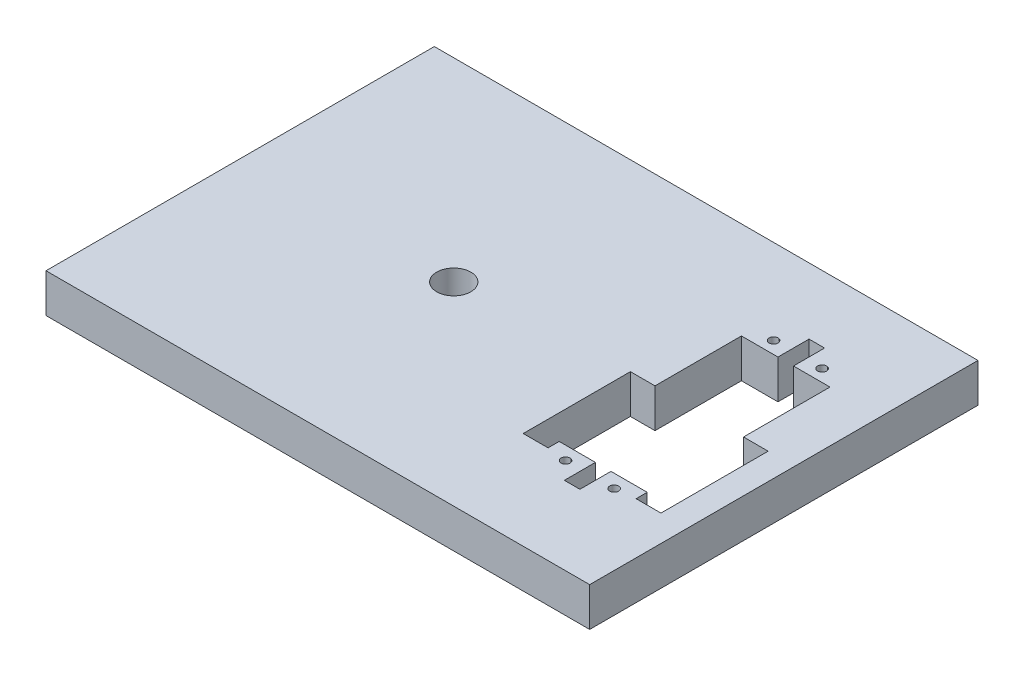
ISO-10303-21;
HEADER;
FILE_DESCRIPTION(('STEP AP214'),'2;1');
FILE_NAME('part.step','',(''),(''),'','','');
FILE_SCHEMA(('AUTOMOTIVE_DESIGN { 1 0 10303 214 1 1 1 1 }'));
ENDSEC;
DATA;
#1=APPLICATION_CONTEXT('core data for automotive mechanical design processes');
#2=APPLICATION_PROTOCOL_DEFINITION('international standard','automotive_design',2000,#1);
#3=PRODUCT_CONTEXT('',#1,'mechanical');
#4=PRODUCT('Part','Part','',(#3));
#5=PRODUCT_RELATED_PRODUCT_CATEGORY('part','',(#4));
#6=PRODUCT_DEFINITION_FORMATION('','',#4);
#7=PRODUCT_DEFINITION_CONTEXT('part definition',#1,'design');
#8=PRODUCT_DEFINITION('design','',#6,#7);
#9=PRODUCT_DEFINITION_SHAPE('','',#8);
#10=(LENGTH_UNIT() NAMED_UNIT(*) SI_UNIT(.MILLI.,.METRE.));
#11=(NAMED_UNIT(*) PLANE_ANGLE_UNIT() SI_UNIT($,.RADIAN.));
#12=(NAMED_UNIT(*) SI_UNIT($,.STERADIAN.) SOLID_ANGLE_UNIT());
#13=UNCERTAINTY_MEASURE_WITH_UNIT(LENGTH_MEASURE(1.E-05),#10,'distance_accuracy_value','');
#14=(GEOMETRIC_REPRESENTATION_CONTEXT(3) GLOBAL_UNCERTAINTY_ASSIGNED_CONTEXT((#13)) GLOBAL_UNIT_ASSIGNED_CONTEXT((#10,
#11,#12)) REPRESENTATION_CONTEXT('',''));
#15=CARTESIAN_POINT('',(0.,0.,0.));
#16=DIRECTION('',(0.,0.,1.));
#17=DIRECTION('',(1.,0.,0.));
#18=AXIS2_PLACEMENT_3D('',#15,#16,#17);
#19=CARTESIAN_POINT('',(0.,12.7,0.));
#20=DIRECTION('',(0.,1.,0.));
#21=DIRECTION('',(0.,0.,1.));
#22=AXIS2_PLACEMENT_3D('',#19,#20,#21);
#23=PLANE('',#22);
#24=CARTESIAN_POINT('',(49.8255656952032,12.7,-35.7195444521175));
#25=DIRECTION('',(0.,1.,0.));
#26=DIRECTION('',(0.,0.,1.));
#27=AXIS2_PLACEMENT_3D('',#24,#25,#26);
#28=CIRCLE('',#27,1.4605);
#29=CARTESIAN_POINT('',(49.8255656952032,12.7,-34.2590444521175));
#30=VERTEX_POINT('',#29);
#31=EDGE_CURVE('E395',#30,#30,#28,.T.);
#32=ORIENTED_EDGE('',*,*,#31,.F.);
#33=EDGE_LOOP('',(#32));
#34=FACE_BOUND('',#33,.T.);
#35=CARTESIAN_POINT('',(49.8255656952034,12.7,32.3016555478825));
#36=DIRECTION('',(0.,1.,0.));
#37=DIRECTION('',(0.,0.,1.));
#38=AXIS2_PLACEMENT_3D('',#35,#36,#37);
#39=CIRCLE('',#38,1.4605);
#40=CARTESIAN_POINT('',(49.8255656952034,12.7,33.7621555478825));
#41=VERTEX_POINT('',#40);
#42=EDGE_CURVE('E237',#41,#41,#39,.T.);
#43=ORIENTED_EDGE('',*,*,#42,.F.);
#44=EDGE_LOOP('',(#43));
#45=FACE_BOUND('',#44,.T.);
#46=DIRECTION('',(0.,0.,-1.));
#47=VECTOR('',#46,1.);
#48=CARTESIAN_POINT('',(88.9,12.7,-63.5));
#49=LINE('',#48,#47);
#50=CARTESIAN_POINT('',(88.9,12.7,63.5));
#51=VERTEX_POINT('',#50);
#52=CARTESIAN_POINT('',(88.9,12.7,-63.5));
#53=VERTEX_POINT('',#52);
#54=EDGE_CURVE('E257',#51,#53,#49,.T.);
#55=ORIENTED_EDGE('',*,*,#54,.T.);
#56=DIRECTION('',(-1.,0.,0.));
#57=VECTOR('',#56,1.);
#58=CARTESIAN_POINT('',(-88.9,12.7,-63.5));
#59=LINE('',#58,#57);
#60=CARTESIAN_POINT('',(-88.9,12.7,-63.5));
#61=VERTEX_POINT('',#60);
#62=EDGE_CURVE('E260',#53,#61,#59,.T.);
#63=ORIENTED_EDGE('',*,*,#62,.T.);
#64=DIRECTION('',(0.,0.,1.));
#65=VECTOR('',#64,1.);
#66=CARTESIAN_POINT('',(-88.9,12.7,-63.5));
#67=LINE('',#66,#65);
#68=CARTESIAN_POINT('',(-88.9,12.7,63.5));
#69=VERTEX_POINT('',#68);
#70=EDGE_CURVE('E263',#61,#69,#67,.T.);
#71=ORIENTED_EDGE('',*,*,#70,.T.);
#72=DIRECTION('',(1.,0.,0.));
#73=VECTOR('',#72,1.);
#74=CARTESIAN_POINT('',(-88.9,12.7,63.5));
#75=LINE('',#74,#73);
#76=EDGE_CURVE('E265',#69,#51,#75,.T.);
#77=ORIENTED_EDGE('',*,*,#76,.T.);
#78=EDGE_LOOP('',(#55,#63,#71,#77));
#79=FACE_BOUND('',#78,.T.);
#80=CARTESIAN_POINT('',(-19.05,12.7,0.));
#81=DIRECTION('',(0.,1.,0.));
#82=DIRECTION('',(0.,0.,1.));
#83=AXIS2_PLACEMENT_3D('',#80,#81,#82);
#84=CIRCLE('',#83,5.58799999999999);
#85=CARTESIAN_POINT('',(-19.05,12.7,5.58799999999998));
#86=VERTEX_POINT('',#85);
#87=EDGE_CURVE('E251',#86,#86,#84,.T.);
#88=ORIENTED_EDGE('',*,*,#87,.F.);
#89=EDGE_LOOP('',(#88));
#90=FACE_BOUND('',#89,.T.);
#91=CARTESIAN_POINT('',(65.7005656952038,12.7,32.3016555478825));
#92=DIRECTION('',(0.,1.,0.));
#93=DIRECTION('',(0.,0.,1.));
#94=AXIS2_PLACEMENT_3D('',#91,#92,#93);
#95=CIRCLE('',#94,1.46049999999967);
#96=CARTESIAN_POINT('',(65.7005656952038,12.7,33.7621555478822));
#97=VERTEX_POINT('',#96);
#98=EDGE_CURVE('E401',#97,#97,#95,.T.);
#99=ORIENTED_EDGE('',*,*,#98,.F.);
#100=EDGE_LOOP('',(#99));
#101=FACE_BOUND('',#100,.T.);
#102=CARTESIAN_POINT('',(65.7005656952032,12.7,-35.7195444521175));
#103=DIRECTION('',(0.,1.,0.));
#104=DIRECTION('',(0.,0.,1.));
#105=AXIS2_PLACEMENT_3D('',#102,#103,#104);
#106=CIRCLE('',#105,1.4605);
#107=CARTESIAN_POINT('',(65.7005656952032,12.7,-34.2590444521175));
#108=VERTEX_POINT('',#107);
#109=EDGE_CURVE('E389',#108,#108,#106,.T.);
#110=ORIENTED_EDGE('',*,*,#109,.F.);
#111=EDGE_LOOP('',(#110));
#112=FACE_BOUND('',#111,.T.);
#113=DIRECTION('',(-1.,0.,0.));
#114=VECTOR('',#113,1.);
#115=CARTESIAN_POINT('',(43.2850656952034,12.7,-31.7539694521175));
#116=LINE('',#115,#114);
#117=CARTESIAN_POINT('',(55.2230656952043,12.7,-31.7539694521175));
#118=VERTEX_POINT('',#117);
#119=CARTESIAN_POINT('',(43.2850656952034,12.7,-31.7539694521175));
#120=VERTEX_POINT('',#119);
#121=EDGE_CURVE('E214',#118,#120,#116,.T.);
#122=ORIENTED_EDGE('',*,*,#121,.F.);
#123=DIRECTION('',(0.,0.,1.));
#124=VECTOR('',#123,1.);
#125=CARTESIAN_POINT('',(55.2230656952043,12.7,-41.9139694521175));
#126=LINE('',#125,#124);
#127=CARTESIAN_POINT('',(55.2230656952043,12.7,-41.9139694521175));
#128=VERTEX_POINT('',#127);
#129=EDGE_CURVE('E197',#128,#118,#126,.T.);
#130=ORIENTED_EDGE('',*,*,#129,.F.);
#131=DIRECTION('',(-1.,0.,0.));
#132=VECTOR('',#131,1.);
#133=CARTESIAN_POINT('',(55.2230656952043,12.7,-41.9139694521175));
#134=LINE('',#133,#132);
#135=CARTESIAN_POINT('',(60.303065695204,12.7,-41.9139694521175));
#136=VERTEX_POINT('',#135);
#137=EDGE_CURVE('E307',#136,#128,#134,.T.);
#138=ORIENTED_EDGE('',*,*,#137,.F.);
#139=DIRECTION('',(0.,0.,-1.));
#140=VECTOR('',#139,1.);
#141=CARTESIAN_POINT('',(60.303065695204,12.7,-41.9139694521175));
#142=LINE('',#141,#140);
#143=CARTESIAN_POINT('',(60.303065695204,12.7,-31.7539694521175));
#144=VERTEX_POINT('',#143);
#145=EDGE_CURVE('E207',#144,#136,#142,.T.);
#146=ORIENTED_EDGE('',*,*,#145,.F.);
#147=CARTESIAN_POINT('',(72.2410656952034,12.7,-31.7539694521175));
#148=VERTEX_POINT('',#147);
#149=EDGE_CURVE('E224',#148,#144,#116,.T.);
#150=ORIENTED_EDGE('',*,*,#149,.F.);
#151=DIRECTION('',(0.,0.,-1.));
#152=VECTOR('',#151,1.);
#153=CARTESIAN_POINT('',(72.2410656952034,12.7,27.9360305478825));
#154=LINE('',#153,#152);
#155=CARTESIAN_POINT('',(72.2410656952034,12.7,-3.48059445211715));
#156=VERTEX_POINT('',#155);
#157=EDGE_CURVE('E225',#156,#148,#154,.T.);
#158=ORIENTED_EDGE('',*,*,#157,.F.);
#159=DIRECTION('',(-1.,0.,0.));
#160=VECTOR('',#159,1.);
#161=CARTESIAN_POINT('',(72.1601426080094,12.7,-3.48059445211715));
#162=LINE('',#161,#160);
#163=CARTESIAN_POINT('',(80.2881426080094,12.7,-3.48059445211715));
#164=VERTEX_POINT('',#163);
#165=EDGE_CURVE('E364',#164,#156,#162,.T.);
#166=ORIENTED_EDGE('',*,*,#165,.F.);
#167=DIRECTION('',(0.,0.,-1.));
#168=VECTOR('',#167,1.);
#169=CARTESIAN_POINT('',(80.2881426080094,12.7,-3.48059445211715));
#170=LINE('',#169,#168);
#171=CARTESIAN_POINT('',(80.2881426080094,12.7,31.5714055478828));
#172=VERTEX_POINT('',#171);
#173=EDGE_CURVE('E362',#172,#164,#170,.T.);
#174=ORIENTED_EDGE('',*,*,#173,.F.);
#175=DIRECTION('',(1.,0.,0.));
#176=VECTOR('',#175,1.);
#177=CARTESIAN_POINT('',(72.1601426080094,12.7,31.5714055478828));
#178=LINE('',#177,#176);
#179=CARTESIAN_POINT('',(72.1601426080094,12.7,31.5714055478828));
#180=VERTEX_POINT('',#179);
#181=EDGE_CURVE('E369',#180,#172,#178,.T.);
#182=ORIENTED_EDGE('',*,*,#181,.F.);
#183=DIRECTION('',(0.,0.,1.));
#184=VECTOR('',#183,1.);
#185=CARTESIAN_POINT('',(72.1601426080094,12.7,-3.48059445211715));
#186=LINE('',#185,#184);
#187=CARTESIAN_POINT('',(72.1601426080094,12.7,27.9360305478825));
#188=VERTEX_POINT('',#187);
#189=EDGE_CURVE('E367',#188,#180,#186,.T.);
#190=ORIENTED_EDGE('',*,*,#189,.F.);
#191=DIRECTION('',(1.,0.,0.));
#192=VECTOR('',#191,1.);
#193=CARTESIAN_POINT('',(43.2850656952034,12.7,27.9360305478825));
#194=LINE('',#193,#192);
#195=CARTESIAN_POINT('',(60.303065695204,12.7,27.9360305478825));
#196=VERTEX_POINT('',#195);
#197=EDGE_CURVE('E411',#196,#188,#194,.T.);
#198=ORIENTED_EDGE('',*,*,#197,.F.);
#199=DIRECTION('',(0.,0.,-1.));
#200=VECTOR('',#199,1.);
#201=CARTESIAN_POINT('',(60.303065695204,12.7,27.9360305478825));
#202=LINE('',#201,#200);
#203=CARTESIAN_POINT('',(60.303065695204,12.7,38.0960305478825));
#204=VERTEX_POINT('',#203);
#205=EDGE_CURVE('E58',#204,#196,#202,.T.);
#206=ORIENTED_EDGE('',*,*,#205,.F.);
#207=DIRECTION('',(1.,0.,0.));
#208=VECTOR('',#207,1.);
#209=CARTESIAN_POINT('',(55.223065695204,12.7,38.0960305478825));
#210=LINE('',#209,#208);
#211=CARTESIAN_POINT('',(55.223065695204,12.7,38.0960305478825));
#212=VERTEX_POINT('',#211);
#213=EDGE_CURVE('E317',#212,#204,#210,.T.);
#214=ORIENTED_EDGE('',*,*,#213,.F.);
#215=DIRECTION('',(0.,0.,1.));
#216=VECTOR('',#215,1.);
#217=CARTESIAN_POINT('',(55.223065695204,12.7,27.9360305478825));
#218=LINE('',#217,#216);
#219=CARTESIAN_POINT('',(55.223065695204,12.7,27.9360305478825));
#220=VERTEX_POINT('',#219);
#221=EDGE_CURVE('E315',#220,#212,#218,.T.);
#222=ORIENTED_EDGE('',*,*,#221,.F.);
#223=CARTESIAN_POINT('',(43.3659887823981,12.7,27.9360305478825));
#224=VERTEX_POINT('',#223);
#225=EDGE_CURVE('E229',#224,#220,#194,.T.);
#226=ORIENTED_EDGE('',*,*,#225,.F.);
#227=DIRECTION('',(0.,0.,-1.));
#228=VECTOR('',#227,1.);
#229=CARTESIAN_POINT('',(43.3659887823981,12.7,-3.48059445211715));
#230=LINE('',#229,#228);
#231=CARTESIAN_POINT('',(43.3659887823981,12.7,31.5714055478828));
#232=VERTEX_POINT('',#231);
#233=EDGE_CURVE('E339',#232,#224,#230,.T.);
#234=ORIENTED_EDGE('',*,*,#233,.F.);
#235=DIRECTION('',(1.,0.,0.));
#236=VECTOR('',#235,1.);
#237=CARTESIAN_POINT('',(35.2379887823981,12.7,31.5714055478828));
#238=LINE('',#237,#236);
#239=CARTESIAN_POINT('',(35.2379887823981,12.7,31.5714055478828));
#240=VERTEX_POINT('',#239);
#241=EDGE_CURVE('E346',#240,#232,#238,.T.);
#242=ORIENTED_EDGE('',*,*,#241,.F.);
#243=DIRECTION('',(0.,0.,1.));
#244=VECTOR('',#243,1.);
#245=CARTESIAN_POINT('',(35.2379887823981,12.7,-3.48059445211715));
#246=LINE('',#245,#244);
#247=CARTESIAN_POINT('',(35.2379887823981,12.7,-3.48059445211715));
#248=VERTEX_POINT('',#247);
#249=EDGE_CURVE('E344',#248,#240,#246,.T.);
#250=ORIENTED_EDGE('',*,*,#249,.F.);
#251=DIRECTION('',(-1.,0.,0.));
#252=VECTOR('',#251,1.);
#253=CARTESIAN_POINT('',(35.2379887823981,12.7,-3.48059445211715));
#254=LINE('',#253,#252);
#255=CARTESIAN_POINT('',(43.2850656952034,12.7,-3.48059445211715));
#256=VERTEX_POINT('',#255);
#257=EDGE_CURVE('E341',#256,#248,#254,.T.);
#258=ORIENTED_EDGE('',*,*,#257,.F.);
#259=DIRECTION('',(0.,0.,1.));
#260=VECTOR('',#259,1.);
#261=CARTESIAN_POINT('',(43.2850656952034,12.7,27.9360305478825));
#262=LINE('',#261,#260);
#263=EDGE_CURVE('E223',#120,#256,#262,.T.);
#264=ORIENTED_EDGE('',*,*,#263,.F.);
#265=EDGE_LOOP('',(#122,#130,#138,#146,#150,#158,#166,#174,#182,#190,#198,#206,#214,#222,#226,
#234,#242,#250,#258,#264));
#266=FACE_BOUND('',#265,.T.);
#267=ADVANCED_FACE('F35',(#34,#45,#79,#90,#101,#112,#266),#23,.T.);
#268=CARTESIAN_POINT('',(0.,0.,0.));
#269=DIRECTION('',(0.,1.,0.));
#270=DIRECTION('',(0.,0.,1.));
#271=AXIS2_PLACEMENT_3D('',#268,#269,#270);
#272=PLANE('',#271);
#273=CARTESIAN_POINT('',(-19.05,0.,0.));
#274=DIRECTION('',(0.,1.,0.));
#275=DIRECTION('',(0.,0.,1.));
#276=AXIS2_PLACEMENT_3D('',#273,#274,#275);
#277=CIRCLE('',#276,5.58799999999999);
#278=CARTESIAN_POINT('',(-19.05,0.,5.58799999999998));
#279=VERTEX_POINT('',#278);
#280=EDGE_CURVE('E250',#279,#279,#277,.T.);
#281=ORIENTED_EDGE('',*,*,#280,.T.);
#282=EDGE_LOOP('',(#281));
#283=FACE_BOUND('',#282,.T.);
#284=DIRECTION('',(0.,0.,-1.));
#285=VECTOR('',#284,1.);
#286=CARTESIAN_POINT('',(88.9,0.,-63.5));
#287=LINE('',#286,#285);
#288=CARTESIAN_POINT('',(88.9,0.,63.5));
#289=VERTEX_POINT('',#288);
#290=CARTESIAN_POINT('',(88.9,0.,-63.5));
#291=VERTEX_POINT('',#290);
#292=EDGE_CURVE('E254',#289,#291,#287,.T.);
#293=ORIENTED_EDGE('',*,*,#292,.F.);
#294=DIRECTION('',(1.,0.,0.));
#295=VECTOR('',#294,1.);
#296=CARTESIAN_POINT('',(-88.9,0.,63.5));
#297=LINE('',#296,#295);
#298=CARTESIAN_POINT('',(-88.9,0.,63.5));
#299=VERTEX_POINT('',#298);
#300=EDGE_CURVE('E261',#299,#289,#297,.T.);
#301=ORIENTED_EDGE('',*,*,#300,.F.);
#302=DIRECTION('',(0.,0.,1.));
#303=VECTOR('',#302,1.);
#304=CARTESIAN_POINT('',(-88.9,0.,-63.5));
#305=LINE('',#304,#303);
#306=CARTESIAN_POINT('',(-88.9,0.,-63.5));
#307=VERTEX_POINT('',#306);
#308=EDGE_CURVE('E272',#307,#299,#305,.T.);
#309=ORIENTED_EDGE('',*,*,#308,.F.);
#310=DIRECTION('',(-1.,0.,0.));
#311=VECTOR('',#310,1.);
#312=CARTESIAN_POINT('',(-88.9,0.,-63.5));
#313=LINE('',#312,#311);
#314=EDGE_CURVE('E270',#291,#307,#313,.T.);
#315=ORIENTED_EDGE('',*,*,#314,.F.);
#316=EDGE_LOOP('',(#293,#301,#309,#315));
#317=FACE_BOUND('',#316,.T.);
#318=CARTESIAN_POINT('',(49.8255656952034,0.,32.3016555478825));
#319=DIRECTION('',(0.,1.,0.));
#320=DIRECTION('',(0.,0.,1.));
#321=AXIS2_PLACEMENT_3D('',#318,#319,#320);
#322=CIRCLE('',#321,1.4605);
#323=CARTESIAN_POINT('',(49.8255656952034,0.,33.7621555478825));
#324=VERTEX_POINT('',#323);
#325=EDGE_CURVE('E404',#324,#324,#322,.T.);
#326=ORIENTED_EDGE('',*,*,#325,.T.);
#327=EDGE_LOOP('',(#326));
#328=FACE_BOUND('',#327,.T.);
#329=CARTESIAN_POINT('',(65.7005656952038,0.,32.3016555478825));
#330=DIRECTION('',(0.,1.,0.));
#331=DIRECTION('',(0.,0.,1.));
#332=AXIS2_PLACEMENT_3D('',#329,#330,#331);
#333=CIRCLE('',#332,1.46049999999967);
#334=CARTESIAN_POINT('',(65.7005656952038,0.,33.7621555478822));
#335=VERTEX_POINT('',#334);
#336=EDGE_CURVE('E398',#335,#335,#333,.T.);
#337=ORIENTED_EDGE('',*,*,#336,.T.);
#338=EDGE_LOOP('',(#337));
#339=FACE_BOUND('',#338,.T.);
#340=CARTESIAN_POINT('',(49.8255656952032,0.,-35.7195444521175));
#341=DIRECTION('',(0.,1.,0.));
#342=DIRECTION('',(0.,0.,1.));
#343=AXIS2_PLACEMENT_3D('',#340,#341,#342);
#344=CIRCLE('',#343,1.4605);
#345=CARTESIAN_POINT('',(49.8255656952032,0.,-34.2590444521175));
#346=VERTEX_POINT('',#345);
#347=EDGE_CURVE('E392',#346,#346,#344,.T.);
#348=ORIENTED_EDGE('',*,*,#347,.T.);
#349=EDGE_LOOP('',(#348));
#350=FACE_BOUND('',#349,.T.);
#351=CARTESIAN_POINT('',(65.7005656952032,0.,-35.7195444521175));
#352=DIRECTION('',(0.,1.,0.));
#353=DIRECTION('',(0.,0.,1.));
#354=AXIS2_PLACEMENT_3D('',#351,#352,#353);
#355=CIRCLE('',#354,1.4605);
#356=CARTESIAN_POINT('',(65.7005656952032,0.,-34.2590444521175));
#357=VERTEX_POINT('',#356);
#358=EDGE_CURVE('E388',#357,#357,#355,.T.);
#359=ORIENTED_EDGE('',*,*,#358,.T.);
#360=EDGE_LOOP('',(#359));
#361=FACE_BOUND('',#360,.T.);
#362=DIRECTION('',(0.,0.,1.));
#363=VECTOR('',#362,1.);
#364=CARTESIAN_POINT('',(55.2230656952043,0.,-41.9139694521175));
#365=LINE('',#364,#363);
#366=CARTESIAN_POINT('',(55.2230656952043,0.,-41.9139694521175));
#367=VERTEX_POINT('',#366);
#368=CARTESIAN_POINT('',(55.2230656952043,0.,-31.7539694521175));
#369=VERTEX_POINT('',#368);
#370=EDGE_CURVE('E302',#367,#369,#365,.T.);
#371=ORIENTED_EDGE('',*,*,#370,.T.);
#372=DIRECTION('',(-1.,0.,0.));
#373=VECTOR('',#372,1.);
#374=CARTESIAN_POINT('',(43.2850656952034,0.,-31.7539694521175));
#375=LINE('',#374,#373);
#376=CARTESIAN_POINT('',(43.2850656952034,0.,-31.7539694521175));
#377=VERTEX_POINT('',#376);
#378=EDGE_CURVE('E216',#369,#377,#375,.T.);
#379=ORIENTED_EDGE('',*,*,#378,.T.);
#380=DIRECTION('',(0.,0.,1.));
#381=VECTOR('',#380,1.);
#382=CARTESIAN_POINT('',(43.2850656952034,0.,27.9360305478825));
#383=LINE('',#382,#381);
#384=CARTESIAN_POINT('',(43.2850656952034,0.,-3.48059445211715));
#385=VERTEX_POINT('',#384);
#386=EDGE_CURVE('E233',#377,#385,#383,.T.);
#387=ORIENTED_EDGE('',*,*,#386,.T.);
#388=DIRECTION('',(-1.,0.,0.));
#389=VECTOR('',#388,1.);
#390=CARTESIAN_POINT('',(35.2379887823981,0.,-3.48059445211715));
#391=LINE('',#390,#389);
#392=CARTESIAN_POINT('',(35.2379887823981,0.,-3.48059445211715));
#393=VERTEX_POINT('',#392);
#394=EDGE_CURVE('E300',#385,#393,#391,.T.);
#395=ORIENTED_EDGE('',*,*,#394,.T.);
#396=DIRECTION('',(0.,0.,1.));
#397=VECTOR('',#396,1.);
#398=CARTESIAN_POINT('',(35.2379887823981,0.,-3.48059445211715));
#399=LINE('',#398,#397);
#400=CARTESIAN_POINT('',(35.2379887823981,0.,31.5714055478828));
#401=VERTEX_POINT('',#400);
#402=EDGE_CURVE('E352',#393,#401,#399,.T.);
#403=ORIENTED_EDGE('',*,*,#402,.T.);
#404=DIRECTION('',(1.,0.,0.));
#405=VECTOR('',#404,1.);
#406=CARTESIAN_POINT('',(35.2379887823981,0.,31.5714055478828));
#407=LINE('',#406,#405);
#408=CARTESIAN_POINT('',(43.3659887823981,0.,31.5714055478828));
#409=VERTEX_POINT('',#408);
#410=EDGE_CURVE('E342',#401,#409,#407,.T.);
#411=ORIENTED_EDGE('',*,*,#410,.T.);
#412=DIRECTION('',(0.,0.,-1.));
#413=VECTOR('',#412,1.);
#414=CARTESIAN_POINT('',(43.3659887823981,0.,-3.48059445211715));
#415=LINE('',#414,#413);
#416=CARTESIAN_POINT('',(43.3659887823981,0.,27.9360305478825));
#417=VERTEX_POINT('',#416);
#418=EDGE_CURVE('E338',#409,#417,#415,.T.);
#419=ORIENTED_EDGE('',*,*,#418,.T.);
#420=DIRECTION('',(1.,0.,0.));
#421=VECTOR('',#420,1.);
#422=CARTESIAN_POINT('',(43.2850656952034,0.,27.9360305478825));
#423=LINE('',#422,#421);
#424=CARTESIAN_POINT('',(55.223065695204,0.,27.9360305478825));
#425=VERTEX_POINT('',#424);
#426=EDGE_CURVE('E238',#417,#425,#423,.T.);
#427=ORIENTED_EDGE('',*,*,#426,.T.);
#428=DIRECTION('',(0.,0.,1.));
#429=VECTOR('',#428,1.);
#430=CARTESIAN_POINT('',(55.223065695204,0.,27.9360305478825));
#431=LINE('',#430,#429);
#432=CARTESIAN_POINT('',(55.223065695204,0.,38.0960305478825));
#433=VERTEX_POINT('',#432);
#434=EDGE_CURVE('E217',#425,#433,#431,.T.);
#435=ORIENTED_EDGE('',*,*,#434,.T.);
#436=DIRECTION('',(1.,0.,0.));
#437=VECTOR('',#436,1.);
#438=CARTESIAN_POINT('',(55.223065695204,0.,38.0960305478825));
#439=LINE('',#438,#437);
#440=CARTESIAN_POINT('',(60.303065695204,0.,38.0960305478825));
#441=VERTEX_POINT('',#440);
#442=EDGE_CURVE('E324',#433,#441,#439,.T.);
#443=ORIENTED_EDGE('',*,*,#442,.T.);
#444=DIRECTION('',(0.,0.,-1.));
#445=VECTOR('',#444,1.);
#446=CARTESIAN_POINT('',(60.303065695204,0.,27.9360305478825));
#447=LINE('',#446,#445);
#448=CARTESIAN_POINT('',(60.303065695204,0.,27.9360305478825));
#449=VERTEX_POINT('',#448);
#450=EDGE_CURVE('E318',#441,#449,#447,.T.);
#451=ORIENTED_EDGE('',*,*,#450,.T.);
#452=CARTESIAN_POINT('',(72.1601426080094,0.,27.9360305478825));
#453=VERTEX_POINT('',#452);
#454=EDGE_CURVE('E236',#449,#453,#423,.T.);
#455=ORIENTED_EDGE('',*,*,#454,.T.);
#456=DIRECTION('',(0.,0.,1.));
#457=VECTOR('',#456,1.);
#458=CARTESIAN_POINT('',(72.1601426080094,0.,-3.48059445211715));
#459=LINE('',#458,#457);
#460=CARTESIAN_POINT('',(72.1601426080094,0.,31.5714055478828));
#461=VERTEX_POINT('',#460);
#462=EDGE_CURVE('E377',#453,#461,#459,.T.);
#463=ORIENTED_EDGE('',*,*,#462,.T.);
#464=DIRECTION('',(1.,0.,0.));
#465=VECTOR('',#464,1.);
#466=CARTESIAN_POINT('',(72.1601426080094,0.,31.5714055478828));
#467=LINE('',#466,#465);
#468=CARTESIAN_POINT('',(80.2881426080094,0.,31.5714055478828));
#469=VERTEX_POINT('',#468);
#470=EDGE_CURVE('E365',#461,#469,#467,.T.);
#471=ORIENTED_EDGE('',*,*,#470,.T.);
#472=DIRECTION('',(0.,0.,-1.));
#473=VECTOR('',#472,1.);
#474=CARTESIAN_POINT('',(80.2881426080094,0.,-3.48059445211715));
#475=LINE('',#474,#473);
#476=CARTESIAN_POINT('',(80.2881426080094,0.,-3.48059445211715));
#477=VERTEX_POINT('',#476);
#478=EDGE_CURVE('E361',#469,#477,#475,.T.);
#479=ORIENTED_EDGE('',*,*,#478,.T.);
#480=DIRECTION('',(-1.,0.,0.));
#481=VECTOR('',#480,1.);
#482=CARTESIAN_POINT('',(72.1601426080094,0.,-3.48059445211715));
#483=LINE('',#482,#481);
#484=CARTESIAN_POINT('',(72.2410656952034,0.,-3.48059445211715));
#485=VERTEX_POINT('',#484);
#486=EDGE_CURVE('E374',#477,#485,#483,.T.);
#487=ORIENTED_EDGE('',*,*,#486,.T.);
#488=DIRECTION('',(0.,0.,-1.));
#489=VECTOR('',#488,1.);
#490=CARTESIAN_POINT('',(72.2410656952034,0.,27.9360305478825));
#491=LINE('',#490,#489);
#492=CARTESIAN_POINT('',(72.2410656952034,0.,-31.7539694521175));
#493=VERTEX_POINT('',#492);
#494=EDGE_CURVE('E241',#485,#493,#491,.T.);
#495=ORIENTED_EDGE('',*,*,#494,.T.);
#496=CARTESIAN_POINT('',(60.303065695204,0.,-31.7539694521175));
#497=VERTEX_POINT('',#496);
#498=EDGE_CURVE('E243',#493,#497,#375,.T.);
#499=ORIENTED_EDGE('',*,*,#498,.T.);
#500=DIRECTION('',(0.,0.,-1.));
#501=VECTOR('',#500,1.);
#502=CARTESIAN_POINT('',(60.303065695204,0.,-41.9139694521175));
#503=LINE('',#502,#501);
#504=CARTESIAN_POINT('',(60.303065695204,0.,-41.9139694521175));
#505=VERTEX_POINT('',#504);
#506=EDGE_CURVE('E50',#497,#505,#503,.T.);
#507=ORIENTED_EDGE('',*,*,#506,.T.);
#508=DIRECTION('',(-1.,0.,0.));
#509=VECTOR('',#508,1.);
#510=CARTESIAN_POINT('',(55.2230656952043,0.,-41.9139694521175));
#511=LINE('',#510,#509);
#512=EDGE_CURVE('E208',#505,#367,#511,.T.);
#513=ORIENTED_EDGE('',*,*,#512,.T.);
#514=EDGE_LOOP('',(#371,#379,#387,#395,#403,#411,#419,#427,#435,#443,#451,#455,#463,#471,#479,
#487,#495,#499,#507,#513));
#515=FACE_BOUND('',#514,.T.);
#516=ADVANCED_FACE('F298',(#283,#317,#328,#339,#350,#361,#515),#272,.F.);
#517=CARTESIAN_POINT('',(43.2850656952034,12.7,-31.7539694521175));
#518=DIRECTION('',(0.,0.,1.));
#519=DIRECTION('',(1.,0.,0.));
#520=AXIS2_PLACEMENT_3D('',#517,#518,#519);
#521=PLANE('',#520);
#522=ORIENTED_EDGE('',*,*,#378,.F.);
#523=DIRECTION('',(0.,-1.,0.));
#524=VECTOR('',#523,1.);
#525=CARTESIAN_POINT('',(55.2230656952043,12.7,-31.7539694521175));
#526=LINE('',#525,#524);
#527=EDGE_CURVE('E201',#118,#369,#526,.T.);
#528=ORIENTED_EDGE('',*,*,#527,.F.);
#529=ORIENTED_EDGE('',*,*,#121,.T.);
#530=DIRECTION('',(0.,-1.,0.));
#531=VECTOR('',#530,1.);
#532=CARTESIAN_POINT('',(43.2850656952034,12.7,-31.7539694521175));
#533=LINE('',#532,#531);
#534=EDGE_CURVE('E228',#120,#377,#533,.T.);
#535=ORIENTED_EDGE('',*,*,#534,.T.);
#536=EDGE_LOOP('',(#522,#528,#529,#535));
#537=FACE_BOUND('',#536,.T.);
#538=ADVANCED_FACE('F212',(#537),#521,.T.);
#539=ORIENTED_EDGE('',*,*,#149,.T.);
#540=DIRECTION('',(0.,-1.,0.));
#541=VECTOR('',#540,1.);
#542=CARTESIAN_POINT('',(60.303065695204,12.7,-31.7539694521175));
#543=LINE('',#542,#541);
#544=EDGE_CURVE('E218',#144,#497,#543,.T.);
#545=ORIENTED_EDGE('',*,*,#544,.T.);
#546=ORIENTED_EDGE('',*,*,#498,.F.);
#547=DIRECTION('',(0.,-1.,0.));
#548=VECTOR('',#547,1.);
#549=CARTESIAN_POINT('',(72.2410656952034,12.7,-31.7539694521175));
#550=LINE('',#549,#548);
#551=EDGE_CURVE('E247',#148,#493,#550,.T.);
#552=ORIENTED_EDGE('',*,*,#551,.F.);
#553=EDGE_LOOP('',(#539,#545,#546,#552));
#554=FACE_BOUND('',#553,.T.);
#555=ADVANCED_FACE('F547',(#554),#521,.T.);
#556=CARTESIAN_POINT('',(43.2850656952034,12.7,27.9360305478825));
#557=DIRECTION('',(0.,0.,-1.));
#558=DIRECTION('',(-1.,0.,0.));
#559=AXIS2_PLACEMENT_3D('',#556,#557,#558);
#560=PLANE('',#559);
#561=ORIENTED_EDGE('',*,*,#225,.T.);
#562=DIRECTION('',(0.,-1.,0.));
#563=VECTOR('',#562,1.);
#564=CARTESIAN_POINT('',(55.223065695204,12.7,27.9360305478825));
#565=LINE('',#564,#563);
#566=EDGE_CURVE('E321',#220,#425,#565,.T.);
#567=ORIENTED_EDGE('',*,*,#566,.T.);
#568=ORIENTED_EDGE('',*,*,#426,.F.);
#569=DIRECTION('',(0.,1.,0.));
#570=VECTOR('',#569,1.);
#571=CARTESIAN_POINT('',(43.3659887823981,12.7,27.9360305478825));
#572=LINE('',#571,#570);
#573=EDGE_CURVE('E11',#417,#224,#572,.T.);
#574=ORIENTED_EDGE('',*,*,#573,.T.);
#575=EDGE_LOOP('',(#561,#567,#568,#574));
#576=FACE_BOUND('',#575,.T.);
#577=ADVANCED_FACE('F447',(#576),#560,.T.);
#578=ORIENTED_EDGE('',*,*,#454,.F.);
#579=DIRECTION('',(0.,-1.,0.));
#580=VECTOR('',#579,1.);
#581=CARTESIAN_POINT('',(60.303065695204,12.7,27.9360305478825));
#582=LINE('',#581,#580);
#583=EDGE_CURVE('E331',#196,#449,#582,.T.);
#584=ORIENTED_EDGE('',*,*,#583,.F.);
#585=ORIENTED_EDGE('',*,*,#197,.T.);
#586=DIRECTION('',(0.,-1.,0.));
#587=VECTOR('',#586,1.);
#588=CARTESIAN_POINT('',(72.1601426080094,12.7,27.9360305478825));
#589=LINE('',#588,#587);
#590=EDGE_CURVE('E289',#188,#453,#589,.T.);
#591=ORIENTED_EDGE('',*,*,#590,.T.);
#592=EDGE_LOOP('',(#578,#584,#585,#591));
#593=FACE_BOUND('',#592,.T.);
#594=ADVANCED_FACE('F419',(#593),#560,.T.);
#595=CARTESIAN_POINT('',(43.2850656952034,12.7,27.9360305478825));
#596=DIRECTION('',(1.,0.,0.));
#597=DIRECTION('',(0.,0.,-1.));
#598=AXIS2_PLACEMENT_3D('',#595,#596,#597);
#599=PLANE('',#598);
#600=ORIENTED_EDGE('',*,*,#263,.T.);
#601=DIRECTION('',(0.,-1.,0.));
#602=VECTOR('',#601,1.);
#603=CARTESIAN_POINT('',(43.2850656952034,12.7,-3.48059445211715));
#604=LINE('',#603,#602);
#605=EDGE_CURVE('E43',#256,#385,#604,.T.);
#606=ORIENTED_EDGE('',*,*,#605,.T.);
#607=ORIENTED_EDGE('',*,*,#386,.F.);
#608=ORIENTED_EDGE('',*,*,#534,.F.);
#609=EDGE_LOOP('',(#600,#606,#607,#608));
#610=FACE_BOUND('',#609,.T.);
#611=ADVANCED_FACE('F294',(#610),#599,.T.);
#612=CARTESIAN_POINT('',(72.2410656952034,12.7,27.9360305478825));
#613=DIRECTION('',(-1.,0.,0.));
#614=DIRECTION('',(0.,0.,1.));
#615=AXIS2_PLACEMENT_3D('',#612,#613,#614);
#616=PLANE('',#615);
#617=ORIENTED_EDGE('',*,*,#494,.F.);
#618=DIRECTION('',(0.,1.,0.));
#619=VECTOR('',#618,1.);
#620=CARTESIAN_POINT('',(72.2410656952034,12.7,-3.48059445211715));
#621=LINE('',#620,#619);
#622=EDGE_CURVE('E286',#485,#156,#621,.T.);
#623=ORIENTED_EDGE('',*,*,#622,.T.);
#624=ORIENTED_EDGE('',*,*,#157,.T.);
#625=ORIENTED_EDGE('',*,*,#551,.T.);
#626=EDGE_LOOP('',(#617,#623,#624,#625));
#627=FACE_BOUND('',#626,.T.);
#628=ADVANCED_FACE('F498',(#627),#616,.T.);
#629=CARTESIAN_POINT('',(88.9,12.7,-63.5));
#630=DIRECTION('',(-1.,0.,0.));
#631=DIRECTION('',(0.,0.,1.));
#632=AXIS2_PLACEMENT_3D('',#629,#630,#631);
#633=PLANE('',#632);
#634=ORIENTED_EDGE('',*,*,#292,.T.);
#635=DIRECTION('',(0.,-1.,0.));
#636=VECTOR('',#635,1.);
#637=CARTESIAN_POINT('',(88.9,12.7,-63.5));
#638=LINE('',#637,#636);
#639=EDGE_CURVE('E283',#53,#291,#638,.T.);
#640=ORIENTED_EDGE('',*,*,#639,.F.);
#641=ORIENTED_EDGE('',*,*,#54,.F.);
#642=DIRECTION('',(0.,-1.,0.));
#643=VECTOR('',#642,1.);
#644=CARTESIAN_POINT('',(88.9,12.7,63.5));
#645=LINE('',#644,#643);
#646=EDGE_CURVE('E267',#51,#289,#645,.T.);
#647=ORIENTED_EDGE('',*,*,#646,.T.);
#648=EDGE_LOOP('',(#634,#640,#641,#647));
#649=FACE_BOUND('',#648,.T.);
#650=ADVANCED_FACE('F37',(#649),#633,.F.);
#651=CARTESIAN_POINT('',(-88.9,12.7,-63.5));
#652=DIRECTION('',(0.,0.,1.));
#653=DIRECTION('',(1.,0.,0.));
#654=AXIS2_PLACEMENT_3D('',#651,#652,#653);
#655=PLANE('',#654);
#656=ORIENTED_EDGE('',*,*,#314,.T.);
#657=DIRECTION('',(0.,-1.,0.));
#658=VECTOR('',#657,1.);
#659=CARTESIAN_POINT('',(-88.9,12.7,-63.5));
#660=LINE('',#659,#658);
#661=EDGE_CURVE('E280',#61,#307,#660,.T.);
#662=ORIENTED_EDGE('',*,*,#661,.F.);
#663=ORIENTED_EDGE('',*,*,#62,.F.);
#664=ORIENTED_EDGE('',*,*,#639,.T.);
#665=EDGE_LOOP('',(#656,#662,#663,#664));
#666=FACE_BOUND('',#665,.T.);
#667=ADVANCED_FACE('F491',(#666),#655,.F.);
#668=CARTESIAN_POINT('',(-88.9,12.7,-63.5));
#669=DIRECTION('',(1.,0.,0.));
#670=DIRECTION('',(0.,0.,-1.));
#671=AXIS2_PLACEMENT_3D('',#668,#669,#670);
#672=PLANE('',#671);
#673=ORIENTED_EDGE('',*,*,#308,.T.);
#674=DIRECTION('',(0.,-1.,0.));
#675=VECTOR('',#674,1.);
#676=CARTESIAN_POINT('',(-88.9,12.7,63.5));
#677=LINE('',#676,#675);
#678=EDGE_CURVE('E277',#69,#299,#677,.T.);
#679=ORIENTED_EDGE('',*,*,#678,.F.);
#680=ORIENTED_EDGE('',*,*,#70,.F.);
#681=ORIENTED_EDGE('',*,*,#661,.T.);
#682=EDGE_LOOP('',(#673,#679,#680,#681));
#683=FACE_BOUND('',#682,.T.);
#684=ADVANCED_FACE('F488',(#683),#672,.F.);
#685=CARTESIAN_POINT('',(-88.9,12.7,63.5));
#686=DIRECTION('',(0.,0.,-1.));
#687=DIRECTION('',(-1.,0.,0.));
#688=AXIS2_PLACEMENT_3D('',#685,#686,#687);
#689=PLANE('',#688);
#690=ORIENTED_EDGE('',*,*,#300,.T.);
#691=ORIENTED_EDGE('',*,*,#646,.F.);
#692=ORIENTED_EDGE('',*,*,#76,.F.);
#693=ORIENTED_EDGE('',*,*,#678,.T.);
#694=EDGE_LOOP('',(#690,#691,#692,#693));
#695=FACE_BOUND('',#694,.T.);
#696=ADVANCED_FACE('F485',(#695),#689,.F.);
#697=CARTESIAN_POINT('',(-19.05,12.7,0.));
#698=DIRECTION('',(0.,-1.,0.));
#699=DIRECTION('',(0.,0.,-1.));
#700=AXIS2_PLACEMENT_3D('',#697,#698,#699);
#701=CYLINDRICAL_SURFACE('',#700,5.58799999999999);
#702=ORIENTED_EDGE('',*,*,#87,.T.);
#703=EDGE_LOOP('',(#702));
#704=FACE_BOUND('',#703,.T.);
#705=ORIENTED_EDGE('',*,*,#280,.F.);
#706=EDGE_LOOP('',(#705));
#707=FACE_BOUND('',#706,.T.);
#708=ADVANCED_FACE('F482',(#704,#707),#701,.F.);
#709=CARTESIAN_POINT('',(49.8255656952034,12.7,32.3016555478825));
#710=DIRECTION('',(0.,-1.,0.));
#711=DIRECTION('',(0.,0.,-1.));
#712=AXIS2_PLACEMENT_3D('',#709,#710,#711);
#713=CYLINDRICAL_SURFACE('',#712,1.4605);
#714=ORIENTED_EDGE('',*,*,#42,.T.);
#715=EDGE_LOOP('',(#714));
#716=FACE_BOUND('',#715,.T.);
#717=ORIENTED_EDGE('',*,*,#325,.F.);
#718=EDGE_LOOP('',(#717));
#719=FACE_BOUND('',#718,.T.);
#720=ADVANCED_FACE('F540',(#716,#719),#713,.F.);
#721=CARTESIAN_POINT('',(65.7005656952038,12.7,32.3016555478825));
#722=DIRECTION('',(0.,-1.,0.));
#723=DIRECTION('',(0.,0.,-1.));
#724=AXIS2_PLACEMENT_3D('',#721,#722,#723);
#725=CYLINDRICAL_SURFACE('',#724,1.46049999999967);
#726=ORIENTED_EDGE('',*,*,#98,.T.);
#727=EDGE_LOOP('',(#726));
#728=FACE_BOUND('',#727,.T.);
#729=ORIENTED_EDGE('',*,*,#336,.F.);
#730=EDGE_LOOP('',(#729));
#731=FACE_BOUND('',#730,.T.);
#732=ADVANCED_FACE('F533',(#728,#731),#725,.F.);
#733=CARTESIAN_POINT('',(49.8255656952032,12.7,-35.7195444521175));
#734=DIRECTION('',(0.,-1.,0.));
#735=DIRECTION('',(0.,0.,-1.));
#736=AXIS2_PLACEMENT_3D('',#733,#734,#735);
#737=CYLINDRICAL_SURFACE('',#736,1.4605);
#738=ORIENTED_EDGE('',*,*,#31,.T.);
#739=EDGE_LOOP('',(#738));
#740=FACE_BOUND('',#739,.T.);
#741=ORIENTED_EDGE('',*,*,#347,.F.);
#742=EDGE_LOOP('',(#741));
#743=FACE_BOUND('',#742,.T.);
#744=ADVANCED_FACE('F523',(#740,#743),#737,.F.);
#745=CARTESIAN_POINT('',(65.7005656952032,12.7,-35.7195444521175));
#746=DIRECTION('',(0.,-1.,0.));
#747=DIRECTION('',(0.,0.,-1.));
#748=AXIS2_PLACEMENT_3D('',#745,#746,#747);
#749=CYLINDRICAL_SURFACE('',#748,1.4605);
#750=ORIENTED_EDGE('',*,*,#109,.T.);
#751=EDGE_LOOP('',(#750));
#752=FACE_BOUND('',#751,.T.);
#753=ORIENTED_EDGE('',*,*,#358,.F.);
#754=EDGE_LOOP('',(#753));
#755=FACE_BOUND('',#754,.T.);
#756=ADVANCED_FACE('F520',(#752,#755),#749,.F.);
#757=CARTESIAN_POINT('',(80.2881426080094,12.7,-3.48059445211715));
#758=DIRECTION('',(-1.,0.,0.));
#759=DIRECTION('',(0.,0.,1.));
#760=AXIS2_PLACEMENT_3D('',#757,#758,#759);
#761=PLANE('',#760);
#762=ORIENTED_EDGE('',*,*,#478,.F.);
#763=DIRECTION('',(0.,-1.,0.));
#764=VECTOR('',#763,1.);
#765=CARTESIAN_POINT('',(80.2881426080094,12.7,31.5714055478828));
#766=LINE('',#765,#764);
#767=EDGE_CURVE('E371',#172,#469,#766,.T.);
#768=ORIENTED_EDGE('',*,*,#767,.F.);
#769=ORIENTED_EDGE('',*,*,#173,.T.);
#770=DIRECTION('',(0.,-1.,0.));
#771=VECTOR('',#770,1.);
#772=CARTESIAN_POINT('',(80.2881426080094,12.7,-3.48059445211715));
#773=LINE('',#772,#771);
#774=EDGE_CURVE('E385',#164,#477,#773,.T.);
#775=ORIENTED_EDGE('',*,*,#774,.T.);
#776=EDGE_LOOP('',(#762,#768,#769,#775));
#777=FACE_BOUND('',#776,.T.);
#778=ADVANCED_FACE('F434',(#777),#761,.T.);
#779=CARTESIAN_POINT('',(72.1601426080094,12.7,-3.48059445211715));
#780=DIRECTION('',(0.,0.,1.));
#781=DIRECTION('',(1.,0.,0.));
#782=AXIS2_PLACEMENT_3D('',#779,#780,#781);
#783=PLANE('',#782);
#784=ORIENTED_EDGE('',*,*,#486,.F.);
#785=ORIENTED_EDGE('',*,*,#774,.F.);
#786=ORIENTED_EDGE('',*,*,#165,.T.);
#787=ORIENTED_EDGE('',*,*,#622,.F.);
#788=EDGE_LOOP('',(#784,#785,#786,#787));
#789=FACE_BOUND('',#788,.T.);
#790=ADVANCED_FACE('F531',(#789),#783,.T.);
#791=CARTESIAN_POINT('',(72.1601426080094,12.7,-3.48059445211715));
#792=DIRECTION('',(1.,0.,0.));
#793=DIRECTION('',(0.,0.,-1.));
#794=AXIS2_PLACEMENT_3D('',#791,#792,#793);
#795=PLANE('',#794);
#796=ORIENTED_EDGE('',*,*,#189,.T.);
#797=DIRECTION('',(0.,-1.,0.));
#798=VECTOR('',#797,1.);
#799=CARTESIAN_POINT('',(72.1601426080094,12.7,31.5714055478828));
#800=LINE('',#799,#798);
#801=EDGE_CURVE('E383',#180,#461,#800,.T.);
#802=ORIENTED_EDGE('',*,*,#801,.T.);
#803=ORIENTED_EDGE('',*,*,#462,.F.);
#804=ORIENTED_EDGE('',*,*,#590,.F.);
#805=EDGE_LOOP('',(#796,#802,#803,#804));
#806=FACE_BOUND('',#805,.T.);
#807=ADVANCED_FACE('F423',(#806),#795,.T.);
#808=CARTESIAN_POINT('',(72.1601426080094,12.7,31.5714055478828));
#809=DIRECTION('',(0.,0.,-1.));
#810=DIRECTION('',(-1.,0.,0.));
#811=AXIS2_PLACEMENT_3D('',#808,#809,#810);
#812=PLANE('',#811);
#813=ORIENTED_EDGE('',*,*,#470,.F.);
#814=ORIENTED_EDGE('',*,*,#801,.F.);
#815=ORIENTED_EDGE('',*,*,#181,.T.);
#816=ORIENTED_EDGE('',*,*,#767,.T.);
#817=EDGE_LOOP('',(#813,#814,#815,#816));
#818=FACE_BOUND('',#817,.T.);
#819=ADVANCED_FACE('F431',(#818),#812,.T.);
#820=CARTESIAN_POINT('',(43.3659887823981,12.7,-3.48059445211715));
#821=DIRECTION('',(-1.,0.,0.));
#822=DIRECTION('',(0.,0.,1.));
#823=AXIS2_PLACEMENT_3D('',#820,#821,#822);
#824=PLANE('',#823);
#825=ORIENTED_EDGE('',*,*,#418,.F.);
#826=DIRECTION('',(0.,-1.,0.));
#827=VECTOR('',#826,1.);
#828=CARTESIAN_POINT('',(43.3659887823981,12.7,31.5714055478828));
#829=LINE('',#828,#827);
#830=EDGE_CURVE('E348',#232,#409,#829,.T.);
#831=ORIENTED_EDGE('',*,*,#830,.F.);
#832=ORIENTED_EDGE('',*,*,#233,.T.);
#833=ORIENTED_EDGE('',*,*,#573,.F.);
#834=EDGE_LOOP('',(#825,#831,#832,#833));
#835=FACE_BOUND('',#834,.T.);
#836=ADVANCED_FACE('F453',(#835),#824,.T.);
#837=CARTESIAN_POINT('',(35.2379887823981,12.7,-3.48059445211715));
#838=DIRECTION('',(0.,0.,1.));
#839=DIRECTION('',(1.,0.,0.));
#840=AXIS2_PLACEMENT_3D('',#837,#838,#839);
#841=PLANE('',#840);
#842=ORIENTED_EDGE('',*,*,#257,.T.);
#843=DIRECTION('',(0.,-1.,0.));
#844=VECTOR('',#843,1.);
#845=CARTESIAN_POINT('',(35.2379887823981,12.7,-3.48059445211715));
#846=LINE('',#845,#844);
#847=EDGE_CURVE('E359',#248,#393,#846,.T.);
#848=ORIENTED_EDGE('',*,*,#847,.T.);
#849=ORIENTED_EDGE('',*,*,#394,.F.);
#850=ORIENTED_EDGE('',*,*,#605,.F.);
#851=EDGE_LOOP('',(#842,#848,#849,#850));
#852=FACE_BOUND('',#851,.T.);
#853=ADVANCED_FACE('F462',(#852),#841,.T.);
#854=CARTESIAN_POINT('',(35.2379887823981,12.7,-3.48059445211715));
#855=DIRECTION('',(1.,0.,0.));
#856=DIRECTION('',(0.,0.,-1.));
#857=AXIS2_PLACEMENT_3D('',#854,#855,#856);
#858=PLANE('',#857);
#859=ORIENTED_EDGE('',*,*,#402,.F.);
#860=ORIENTED_EDGE('',*,*,#847,.F.);
#861=ORIENTED_EDGE('',*,*,#249,.T.);
#862=DIRECTION('',(0.,-1.,0.));
#863=VECTOR('',#862,1.);
#864=CARTESIAN_POINT('',(35.2379887823981,12.7,31.5714055478828));
#865=LINE('',#864,#863);
#866=EDGE_CURVE('E357',#240,#401,#865,.T.);
#867=ORIENTED_EDGE('',*,*,#866,.T.);
#868=EDGE_LOOP('',(#859,#860,#861,#867));
#869=FACE_BOUND('',#868,.T.);
#870=ADVANCED_FACE('F460',(#869),#858,.T.);
#871=CARTESIAN_POINT('',(35.2379887823981,12.7,31.5714055478828));
#872=DIRECTION('',(0.,0.,-1.));
#873=DIRECTION('',(-1.,0.,0.));
#874=AXIS2_PLACEMENT_3D('',#871,#872,#873);
#875=PLANE('',#874);
#876=ORIENTED_EDGE('',*,*,#410,.F.);
#877=ORIENTED_EDGE('',*,*,#866,.F.);
#878=ORIENTED_EDGE('',*,*,#241,.T.);
#879=ORIENTED_EDGE('',*,*,#830,.T.);
#880=EDGE_LOOP('',(#876,#877,#878,#879));
#881=FACE_BOUND('',#880,.T.);
#882=ADVANCED_FACE('F456',(#881),#875,.T.);
#883=CARTESIAN_POINT('',(55.223065695204,12.7,27.9360305478825));
#884=DIRECTION('',(1.,0.,0.));
#885=DIRECTION('',(0.,0.,-1.));
#886=AXIS2_PLACEMENT_3D('',#883,#884,#885);
#887=PLANE('',#886);
#888=ORIENTED_EDGE('',*,*,#434,.F.);
#889=ORIENTED_EDGE('',*,*,#566,.F.);
#890=ORIENTED_EDGE('',*,*,#221,.T.);
#891=DIRECTION('',(0.,-1.,0.));
#892=VECTOR('',#891,1.);
#893=CARTESIAN_POINT('',(55.223065695204,12.7,38.0960305478825));
#894=LINE('',#893,#892);
#895=EDGE_CURVE('E335',#212,#433,#894,.T.);
#896=ORIENTED_EDGE('',*,*,#895,.T.);
#897=EDGE_LOOP('',(#888,#889,#890,#896));
#898=FACE_BOUND('',#897,.T.);
#899=ADVANCED_FACE('F444',(#898),#887,.T.);
#900=CARTESIAN_POINT('',(55.223065695204,12.7,38.0960305478825));
#901=DIRECTION('',(0.,0.,-1.));
#902=DIRECTION('',(-1.,0.,0.));
#903=AXIS2_PLACEMENT_3D('',#900,#901,#902);
#904=PLANE('',#903);
#905=ORIENTED_EDGE('',*,*,#442,.F.);
#906=ORIENTED_EDGE('',*,*,#895,.F.);
#907=ORIENTED_EDGE('',*,*,#213,.T.);
#908=DIRECTION('',(0.,-1.,0.));
#909=VECTOR('',#908,1.);
#910=CARTESIAN_POINT('',(60.303065695204,12.7,38.0960305478825));
#911=LINE('',#910,#909);
#912=EDGE_CURVE('E333',#204,#441,#911,.T.);
#913=ORIENTED_EDGE('',*,*,#912,.T.);
#914=EDGE_LOOP('',(#905,#906,#907,#913));
#915=FACE_BOUND('',#914,.T.);
#916=ADVANCED_FACE('F442',(#915),#904,.T.);
#917=CARTESIAN_POINT('',(60.303065695204,12.7,27.9360305478825));
#918=DIRECTION('',(-1.,0.,0.));
#919=DIRECTION('',(0.,0.,1.));
#920=AXIS2_PLACEMENT_3D('',#917,#918,#919);
#921=PLANE('',#920);
#922=ORIENTED_EDGE('',*,*,#450,.F.);
#923=ORIENTED_EDGE('',*,*,#912,.F.);
#924=ORIENTED_EDGE('',*,*,#205,.T.);
#925=ORIENTED_EDGE('',*,*,#583,.T.);
#926=EDGE_LOOP('',(#922,#923,#924,#925));
#927=FACE_BOUND('',#926,.T.);
#928=ADVANCED_FACE('F437',(#927),#921,.T.);
#929=CARTESIAN_POINT('',(55.2230656952043,12.7,-41.9139694521175));
#930=DIRECTION('',(1.,0.,0.));
#931=DIRECTION('',(0.,0.,-1.));
#932=AXIS2_PLACEMENT_3D('',#929,#930,#931);
#933=PLANE('',#932);
#934=ORIENTED_EDGE('',*,*,#370,.F.);
#935=DIRECTION('',(0.,-1.,0.));
#936=VECTOR('',#935,1.);
#937=CARTESIAN_POINT('',(55.2230656952043,12.7,-41.9139694521175));
#938=LINE('',#937,#936);
#939=EDGE_CURVE('E203',#128,#367,#938,.T.);
#940=ORIENTED_EDGE('',*,*,#939,.F.);
#941=ORIENTED_EDGE('',*,*,#129,.T.);
#942=ORIENTED_EDGE('',*,*,#527,.T.);
#943=EDGE_LOOP('',(#934,#940,#941,#942));
#944=FACE_BOUND('',#943,.T.);
#945=ADVANCED_FACE('F200',(#944),#933,.T.);
#946=CARTESIAN_POINT('',(60.303065695204,12.7,-41.9139694521175));
#947=DIRECTION('',(-1.,0.,0.));
#948=DIRECTION('',(0.,0.,1.));
#949=AXIS2_PLACEMENT_3D('',#946,#947,#948);
#950=PLANE('',#949);
#951=ORIENTED_EDGE('',*,*,#506,.F.);
#952=ORIENTED_EDGE('',*,*,#544,.F.);
#953=ORIENTED_EDGE('',*,*,#145,.T.);
#954=DIRECTION('',(0.,-1.,0.));
#955=VECTOR('',#954,1.);
#956=CARTESIAN_POINT('',(60.303065695204,12.7,-41.9139694521175));
#957=LINE('',#956,#955);
#958=EDGE_CURVE('E312',#136,#505,#957,.T.);
#959=ORIENTED_EDGE('',*,*,#958,.T.);
#960=EDGE_LOOP('',(#951,#952,#953,#959));
#961=FACE_BOUND('',#960,.T.);
#962=ADVANCED_FACE('F727',(#961),#950,.T.);
#963=CARTESIAN_POINT('',(55.2230656952043,12.7,-41.9139694521175));
#964=DIRECTION('',(0.,0.,1.));
#965=DIRECTION('',(1.,0.,0.));
#966=AXIS2_PLACEMENT_3D('',#963,#964,#965);
#967=PLANE('',#966);
#968=ORIENTED_EDGE('',*,*,#512,.F.);
#969=ORIENTED_EDGE('',*,*,#958,.F.);
#970=ORIENTED_EDGE('',*,*,#137,.T.);
#971=ORIENTED_EDGE('',*,*,#939,.T.);
#972=EDGE_LOOP('',(#968,#969,#970,#971));
#973=FACE_BOUND('',#972,.T.);
#974=ADVANCED_FACE('F736',(#973),#967,.T.);
#975=CLOSED_SHELL('',(#267,#516,#538,#555,#577,#594,#611,#628,#650,#667,#684,#696,#708,#720,
#732,#744,#756,#778,#790,#807,#819,#836,#853,#870,#882,#899,#916,#928,#945,#962,#974));
#976=MANIFOLD_SOLID_BREP('B2',#975);
#977=ADVANCED_BREP_SHAPE_REPRESENTATION('',(#18,#976),#14);
#978=SHAPE_DEFINITION_REPRESENTATION(#9,#977);
ENDSEC;
END-ISO-10303-21;
